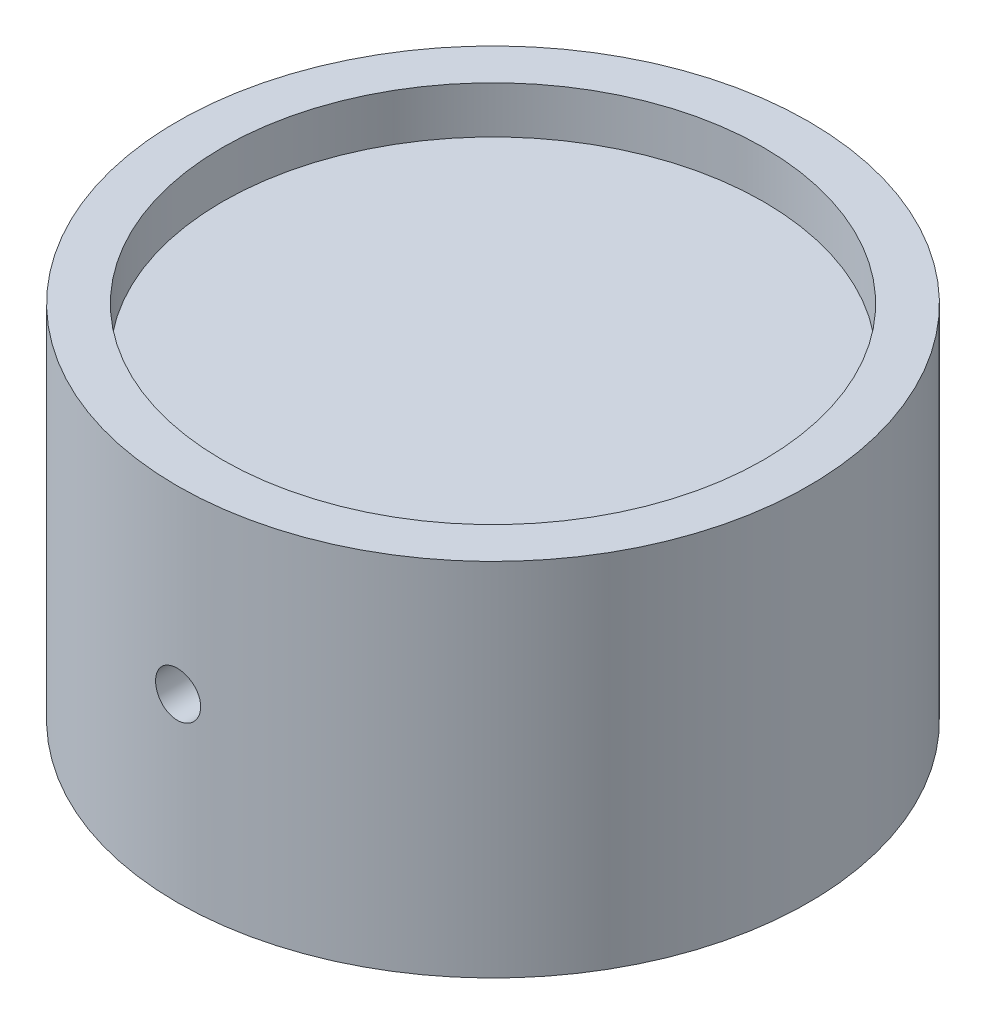
ISO-10303-21;
HEADER;
FILE_DESCRIPTION(('STEP AP214'),'2;1');
FILE_NAME('part.step','',(''),(''),'','','');
FILE_SCHEMA(('AUTOMOTIVE_DESIGN { 1 0 10303 214 1 1 1 1 }'));
ENDSEC;
DATA;
#1=APPLICATION_CONTEXT('core data for automotive mechanical design processes');
#2=APPLICATION_PROTOCOL_DEFINITION('international standard','automotive_design',2000,#1);
#3=PRODUCT_CONTEXT('',#1,'mechanical');
#4=PRODUCT('Part','Part','',(#3));
#5=PRODUCT_RELATED_PRODUCT_CATEGORY('part','',(#4));
#6=PRODUCT_DEFINITION_FORMATION('','',#4);
#7=PRODUCT_DEFINITION_CONTEXT('part definition',#1,'design');
#8=PRODUCT_DEFINITION('design','',#6,#7);
#9=PRODUCT_DEFINITION_SHAPE('','',#8);
#10=(LENGTH_UNIT() NAMED_UNIT(*) SI_UNIT(.MILLI.,.METRE.));
#11=(NAMED_UNIT(*) PLANE_ANGLE_UNIT() SI_UNIT($,.RADIAN.));
#12=(NAMED_UNIT(*) SI_UNIT($,.STERADIAN.) SOLID_ANGLE_UNIT());
#13=UNCERTAINTY_MEASURE_WITH_UNIT(LENGTH_MEASURE(1.E-05),#10,'distance_accuracy_value','');
#14=(GEOMETRIC_REPRESENTATION_CONTEXT(3) GLOBAL_UNCERTAINTY_ASSIGNED_CONTEXT((#13)) GLOBAL_UNIT_ASSIGNED_CONTEXT((#10,
#11,#12)) REPRESENTATION_CONTEXT('',''));
#15=CARTESIAN_POINT('',(0.,0.,0.));
#16=DIRECTION('',(0.,0.,1.));
#17=DIRECTION('',(1.,0.,0.));
#18=AXIS2_PLACEMENT_3D('',#15,#16,#17);
#19=CARTESIAN_POINT('',(0.,25.4,0.));
#20=DIRECTION('',(0.,-1.,0.));
#21=DIRECTION('',(0.,0.,-1.));
#22=AXIS2_PLACEMENT_3D('',#19,#20,#21);
#23=CYLINDRICAL_SURFACE('',#22,22.225);
#24=CARTESIAN_POINT('',(1.58749999999999,12.7,22.1682310694832));
#25=CARTESIAN_POINT('',(1.58749609235026,12.6109515469179,22.168231826125));
#26=CARTESIAN_POINT('',(1.57998224940025,12.5218414219732,22.168773395447));
#27=CARTESIAN_POINT('',(1.55011700578431,12.3460836936577,22.1708813022297));
#28=CARTESIAN_POINT('',(1.52774851511875,12.259439046649,22.1724488199952));
#29=CARTESIAN_POINT('',(1.4688215061279,12.0911834646825,22.1764301750041));
#30=CARTESIAN_POINT('',(1.43227069623717,12.0095698231288,22.1788435524333));
#31=CARTESIAN_POINT('',(1.34602956946576,11.8536567279388,22.1842441178207));
#32=CARTESIAN_POINT('',(1.29634218255635,11.7793556483794,22.1872311777845));
#33=CARTESIAN_POINT('',(1.18513443175129,11.6400134334547,22.1934490084217));
#34=CARTESIAN_POINT('',(1.12359409916664,11.5749882516457,22.1966801846951));
#35=CARTESIAN_POINT('',(0.990469103633874,11.45618043849,22.2030184266813));
#36=CARTESIAN_POINT('',(0.918884014210178,11.402398284736,22.2061254871173));
#37=CARTESIAN_POINT('',(0.767609102895461,11.3075522781098,22.211869075378));
#38=CARTESIAN_POINT('',(0.687910808882627,11.2665019050114,22.2145051032541));
#39=CARTESIAN_POINT('',(0.522731113633086,11.1983709877829,22.2190052930359));
#40=CARTESIAN_POINT('',(0.437249789768195,11.171290256793,22.2208694652659));
#41=CARTESIAN_POINT('',(0.26308664266238,11.1319123805887,22.2236130822647));
#42=CARTESIAN_POINT('',(0.174410584064815,11.1195898587324,22.2244942171804));
#43=CARTESIAN_POINT('',(-0.00375532874157928,11.1099997918277,22.2251781863807));
#44=CARTESIAN_POINT('',(-0.0932451714103631,11.1127320336232,22.2249810359325));
#45=CARTESIAN_POINT('',(-0.270326409054757,11.1331530775943,22.2235320519382));
#46=CARTESIAN_POINT('',(-0.357920969398602,11.1508145867697,22.2222821430117));
#47=CARTESIAN_POINT('',(-0.528899054003579,11.2005504324405,22.2188705225877));
#48=CARTESIAN_POINT('',(-0.612282547319465,11.2326248748329,22.2167088043909));
#49=CARTESIAN_POINT('',(-0.772558865791904,11.3103068257927,22.2117135655237));
#50=CARTESIAN_POINT('',(-0.84944570409023,11.3559266458126,22.2088794341669));
#51=CARTESIAN_POINT('',(-0.994480814460148,11.4593954256644,22.2028581472223));
#52=CARTESIAN_POINT('',(-1.06262895707426,11.5172445666313,22.1996709864058));
#53=CARTESIAN_POINT('',(-1.18841160946314,11.6436838832163,22.1932937313251));
#54=CARTESIAN_POINT('',(-1.24602229898831,11.7122977585049,22.1901036464063));
#55=CARTESIAN_POINT('',(-1.34891088659758,11.8582359908239,22.1840872957399));
#56=CARTESIAN_POINT('',(-1.39418877798898,11.9355603525813,22.1812610301896));
#57=CARTESIAN_POINT('',(-1.4711251115212,12.0967403695783,22.176291610999));
#58=CARTESIAN_POINT('',(-1.50278245876667,12.1805965492421,22.174148512279));
#59=CARTESIAN_POINT('',(-1.55156215570254,12.3524524855519,22.1707889551262));
#60=CARTESIAN_POINT('',(-1.56868472913055,12.4404521783937,22.1695724824297));
#61=CARTESIAN_POINT('',(-1.58787896689999,12.6178891155146,22.1682060548942));
#62=CARTESIAN_POINT('',(-1.58998378448683,12.7073227561323,22.1680537508086));
#63=CARTESIAN_POINT('',(-1.57916947203832,12.8852717314762,22.1688266948214));
#64=CARTESIAN_POINT('',(-1.56625044449786,12.9737870724631,22.1697519355685));
#65=CARTESIAN_POINT('',(-1.5257827442724,13.1472925124985,22.1725735646739));
#66=CARTESIAN_POINT('',(-1.4982494203045,13.2322862093899,22.1744689340766));
#67=CARTESIAN_POINT('',(-1.42935026508389,13.3964469113973,22.1790163866076));
#68=CARTESIAN_POINT('',(-1.38798427014594,13.4756138475503,22.1816684786903));
#69=CARTESIAN_POINT('',(-1.29250960665197,13.6260258324974,22.1874362289003));
#70=CARTESIAN_POINT('',(-1.2383787715021,13.6972567797061,22.1905526899154));
#71=CARTESIAN_POINT('',(-1.11894316675908,13.8296325637712,22.1968952349793));
#72=CARTESIAN_POINT('',(-1.05363825526631,13.890777272523,22.2001213204199));
#73=CARTESIAN_POINT('',(-0.913565347300763,14.0013573569858,22.2063265218481));
#74=CARTESIAN_POINT('',(-0.838780364134121,14.0507712447894,22.2093051782205));
#75=CARTESIAN_POINT('',(-0.681955290350194,14.136339816719,22.2146732914303));
#76=CARTESIAN_POINT('',(-0.599915255526373,14.1724946028004,22.217062752798));
#77=CARTESIAN_POINT('',(-0.430987101631674,14.2304814772378,22.2209810874469));
#78=CARTESIAN_POINT('',(-0.344103628032597,14.2523270419534,22.2225107702702));
#79=CARTESIAN_POINT('',(-0.167890662000527,14.2811194386778,22.2245404462888));
#80=CARTESIAN_POINT('',(-0.0785612023904378,14.288066470512,22.2250404532946));
#81=CARTESIAN_POINT('',(0.0997956802072223,14.2868625264458,22.2249544750983));
#82=CARTESIAN_POINT('',(0.188823332909533,14.2787451218488,22.2243709046617));
#83=CARTESIAN_POINT('',(0.36424788508471,14.2477124946601,22.222188154822));
#84=CARTESIAN_POINT('',(0.450644780291801,14.2247972480749,22.220588973772));
#85=CARTESIAN_POINT('',(0.618359157322722,14.1648274075231,22.2165546178347));
#86=CARTESIAN_POINT('',(0.699676760831319,14.1277731524366,22.2141194629839));
#87=CARTESIAN_POINT('',(0.854941617955433,14.0405813581598,22.2086861856915));
#88=CARTESIAN_POINT('',(0.928889033140696,13.9904441058631,22.2056880755952));
#89=CARTESIAN_POINT('',(1.06748556601891,13.8783842592438,22.1994578933056));
#90=CARTESIAN_POINT('',(1.13211478442566,13.8164370804927,22.1962253419365));
#91=CARTESIAN_POINT('',(1.25008114805185,13.6825549488328,22.1898945892428));
#92=CARTESIAN_POINT('',(1.30341553769478,13.6106175657055,22.1867964208497));
#93=CARTESIAN_POINT('',(1.39733042464984,13.458692553558,22.181080148508));
#94=CARTESIAN_POINT('',(1.43789184941007,13.3786931192099,22.1784627648711));
#95=CARTESIAN_POINT('',(1.50495635417649,13.213057476119,22.174013428587));
#96=CARTESIAN_POINT('',(1.53147578079666,13.1274279526764,22.1721805631426));
#97=CARTESIAN_POINT('',(1.56286515421334,12.9844014469465,22.169984621917));
#98=CARTESIAN_POINT('',(1.57209114476269,12.9279272505286,22.1693300112595));
#99=CARTESIAN_POINT('',(1.58440981622643,12.8143105078716,22.1684529925713));
#100=CARTESIAN_POINT('',(1.58750250866092,12.7571679628879,22.1682305837289));
#101=CARTESIAN_POINT('',(1.58749999999999,12.7,22.1682310694832));
#102=B_SPLINE_CURVE_WITH_KNOTS('',3,(#24,#25,#26,#27,#28,#29,#30,#31,#32,#33,#34,#35,#36,#37,
#38,#39,#40,#41,#42,#43,#44,#45,#46,#47,#48,#49,#50,#51,#52,#53,#54,#55,#56,#57,#58,#59,#60,#61,
#62,#63,#64,#65,#66,#67,#68,#69,#70,#71,#72,#73,#74,#75,#76,#77,#78,#79,#80,#81,#82,#83,#84,#85,
#86,#87,#88,#89,#90,#91,#92,#93,#94,#95,#96,#97,#98,#99,#100,#101),.UNSPECIFIED.,.T.,.F.,(4,2,2,
2,2,2,2,2,2,2,2,2,2,2,2,2,2,2,2,2,2,2,2,2,2,2,2,2,2,2,2,2,2,2,2,2,2,2,4),(0.,0.26693664820637,
0.53418093540041,0.8012801718509,1.0683198848925,1.33581347901297,1.60331843368927,
1.8711056499855,2.13888928423433,2.40621180218837,2.67353053520931,2.9403616227095,
3.20719467074668,3.47427099079376,3.74135126692694,4.009028019754,4.27670491784191,
4.54440332927402,4.81209761987876,5.0792007643521,5.34630208661911,5.61312343822547,
5.87994794730301,6.14723926368506,6.41453397465226,6.68231458818024,6.95009314257618,
7.21761914034851,7.48514154992331,7.75206849791231,8.01899587870051,8.28591686224559,
8.55283199304393,8.82030894428228,9.08785107634614,9.35579082771651,9.62341797464419,
9.79478819538489,9.96615809424217),.UNSPECIFIED.);
#103=CARTESIAN_POINT('',(1.58749999999999,12.7,22.1682310694832));
#104=VERTEX_POINT('',#103);
#105=EDGE_CURVE('E11',#104,#104,#102,.T.);
#106=ORIENTED_EDGE('',*,*,#105,.T.);
#107=EDGE_LOOP('',(#106));
#108=FACE_BOUND('',#107,.T.);
#109=CARTESIAN_POINT('',(0.,25.4,0.));
#110=DIRECTION('',(0.,1.,0.));
#111=DIRECTION('',(0.,0.,1.));
#112=AXIS2_PLACEMENT_3D('',#109,#110,#111);
#113=CIRCLE('',#112,22.225);
#114=CARTESIAN_POINT('',(0.,25.4,22.225));
#115=VERTEX_POINT('',#114);
#116=EDGE_CURVE('E48',#115,#115,#113,.T.);
#117=ORIENTED_EDGE('',*,*,#116,.F.);
#118=EDGE_LOOP('',(#117));
#119=FACE_BOUND('',#118,.T.);
#120=CARTESIAN_POINT('',(0.,0.,0.));
#121=DIRECTION('',(0.,1.,0.));
#122=DIRECTION('',(0.,0.,1.));
#123=AXIS2_PLACEMENT_3D('',#120,#121,#122);
#124=CIRCLE('',#123,22.225);
#125=CARTESIAN_POINT('',(0.,0.,22.225));
#126=VERTEX_POINT('',#125);
#127=EDGE_CURVE('E74',#126,#126,#124,.T.);
#128=ORIENTED_EDGE('',*,*,#127,.T.);
#129=EDGE_LOOP('',(#128));
#130=FACE_BOUND('',#129,.T.);
#131=ADVANCED_FACE('F37',(#108,#119,#130),#23,.T.);
#132=CARTESIAN_POINT('',(0.,25.4,0.));
#133=DIRECTION('',(0.,1.,0.));
#134=DIRECTION('',(0.,0.,1.));
#135=AXIS2_PLACEMENT_3D('',#132,#133,#134);
#136=PLANE('',#135);
#137=CARTESIAN_POINT('',(0.,25.4,0.));
#138=DIRECTION('',(0.,1.,0.));
#139=DIRECTION('',(0.,0.,1.));
#140=AXIS2_PLACEMENT_3D('',#137,#138,#139);
#141=CIRCLE('',#140,19.05);
#142=CARTESIAN_POINT('',(0.,25.4,19.05));
#143=VERTEX_POINT('',#142);
#144=EDGE_CURVE('E68',#143,#143,#141,.T.);
#145=ORIENTED_EDGE('',*,*,#144,.F.);
#146=EDGE_LOOP('',(#145));
#147=FACE_BOUND('',#146,.T.);
#148=ORIENTED_EDGE('',*,*,#116,.T.);
#149=EDGE_LOOP('',(#148));
#150=FACE_BOUND('',#149,.T.);
#151=ADVANCED_FACE('F83',(#147,#150),#136,.T.);
#152=CARTESIAN_POINT('',(0.,0.,0.));
#153=DIRECTION('',(0.,1.,0.));
#154=DIRECTION('',(0.,0.,1.));
#155=AXIS2_PLACEMENT_3D('',#152,#153,#154);
#156=PLANE('',#155);
#157=CARTESIAN_POINT('',(0.,0.,0.));
#158=DIRECTION('',(0.,-1.,0.));
#159=DIRECTION('',(0.,0.,-1.));
#160=AXIS2_PLACEMENT_3D('',#157,#158,#159);
#161=CIRCLE('',#160,19.05);
#162=CARTESIAN_POINT('',(0.,0.,-19.05));
#163=VERTEX_POINT('',#162);
#164=EDGE_CURVE('E60',#163,#163,#161,.T.);
#165=ORIENTED_EDGE('',*,*,#164,.F.);
#166=EDGE_LOOP('',(#165));
#167=FACE_BOUND('',#166,.T.);
#168=ORIENTED_EDGE('',*,*,#127,.F.);
#169=EDGE_LOOP('',(#168));
#170=FACE_BOUND('',#169,.T.);
#171=ADVANCED_FACE('F80',(#167,#170),#156,.F.);
#172=CARTESIAN_POINT('',(0.,22.098,0.));
#173=DIRECTION('',(0.,-1.,0.));
#174=DIRECTION('',(0.,0.,-1.));
#175=AXIS2_PLACEMENT_3D('',#172,#173,#174);
#176=PLANE('',#175);
#177=CARTESIAN_POINT('',(0.,22.098,0.));
#178=DIRECTION('',(0.,1.,0.));
#179=DIRECTION('',(0.,0.,1.));
#180=AXIS2_PLACEMENT_3D('',#177,#178,#179);
#181=CIRCLE('',#180,19.05);
#182=CARTESIAN_POINT('',(0.,22.098,19.05));
#183=VERTEX_POINT('',#182);
#184=EDGE_CURVE('E71',#183,#183,#181,.T.);
#185=ORIENTED_EDGE('',*,*,#184,.T.);
#186=EDGE_LOOP('',(#185));
#187=FACE_BOUND('',#186,.T.);
#188=ADVANCED_FACE('F82',(#187),#176,.F.);
#189=CARTESIAN_POINT('',(0.,25.4,0.));
#190=DIRECTION('',(0.,1.,0.));
#191=DIRECTION('',(0.,0.,1.));
#192=AXIS2_PLACEMENT_3D('',#189,#190,#191);
#193=CYLINDRICAL_SURFACE('',#192,19.05);
#194=ORIENTED_EDGE('',*,*,#184,.F.);
#195=EDGE_LOOP('',(#194));
#196=FACE_BOUND('',#195,.T.);
#197=ORIENTED_EDGE('',*,*,#144,.T.);
#198=EDGE_LOOP('',(#197));
#199=FACE_BOUND('',#198,.T.);
#200=ADVANCED_FACE('F89',(#196,#199),#193,.F.);
#201=CARTESIAN_POINT('',(0.,3.302,0.));
#202=DIRECTION('',(0.,1.,0.));
#203=DIRECTION('',(0.,0.,1.));
#204=AXIS2_PLACEMENT_3D('',#201,#202,#203);
#205=PLANE('',#204);
#206=CARTESIAN_POINT('',(0.,3.302,0.));
#207=DIRECTION('',(0.,-1.,0.));
#208=DIRECTION('',(0.,0.,-1.));
#209=AXIS2_PLACEMENT_3D('',#206,#207,#208);
#210=CIRCLE('',#209,19.05);
#211=CARTESIAN_POINT('',(0.,3.302,-19.05));
#212=VERTEX_POINT('',#211);
#213=EDGE_CURVE('E63',#212,#212,#210,.T.);
#214=ORIENTED_EDGE('',*,*,#213,.T.);
#215=EDGE_LOOP('',(#214));
#216=FACE_BOUND('',#215,.T.);
#217=ADVANCED_FACE('F109',(#216),#205,.F.);
#218=CARTESIAN_POINT('',(0.,0.,0.));
#219=DIRECTION('',(0.,-1.,0.));
#220=DIRECTION('',(0.,0.,-1.));
#221=AXIS2_PLACEMENT_3D('',#218,#219,#220);
#222=CYLINDRICAL_SURFACE('',#221,19.05);
#223=ORIENTED_EDGE('',*,*,#213,.F.);
#224=EDGE_LOOP('',(#223));
#225=FACE_BOUND('',#224,.T.);
#226=ORIENTED_EDGE('',*,*,#164,.T.);
#227=EDGE_LOOP('',(#226));
#228=FACE_BOUND('',#227,.T.);
#229=ADVANCED_FACE('F105',(#225,#228),#222,.F.);
#230=CARTESIAN_POINT('',(0.,12.7,22.225));
#231=DIRECTION('',(0.,0.,1.));
#232=DIRECTION('',(1.,0.,0.));
#233=AXIS2_PLACEMENT_3D('',#230,#231,#232);
#234=CYLINDRICAL_SURFACE('',#233,1.58749999999999);
#235=CARTESIAN_POINT('',(0.,12.7,6.223));
#236=DIRECTION('',(0.,0.,1.));
#237=DIRECTION('',(1.,0.,0.));
#238=AXIS2_PLACEMENT_3D('',#235,#236,#237);
#239=CIRCLE('',#238,1.5875);
#240=CARTESIAN_POINT('',(1.5875,12.7,6.223));
#241=VERTEX_POINT('',#240);
#242=EDGE_CURVE('E58',#241,#241,#239,.T.);
#243=ORIENTED_EDGE('',*,*,#242,.F.);
#244=EDGE_LOOP('',(#243));
#245=FACE_BOUND('',#244,.T.);
#246=ORIENTED_EDGE('',*,*,#105,.F.);
#247=EDGE_LOOP('',(#246));
#248=FACE_BOUND('',#247,.T.);
#249=ADVANCED_FACE('F54',(#245,#248),#234,.F.);
#250=CARTESIAN_POINT('',(0.,12.7,6.223));
#251=DIRECTION('',(0.,0.,1.));
#252=DIRECTION('',(1.,0.,0.));
#253=AXIS2_PLACEMENT_3D('',#250,#251,#252);
#254=CONICAL_SURFACE('',#253,1.5875,1.02974425867665);
#255=CARTESIAN_POINT('',(0.,12.7,5.26913376729375));
#256=VERTEX_POINT('',#255);
#257=VERTEX_LOOP('',#256);
#258=FACE_BOUND('',#257,.T.);
#259=ORIENTED_EDGE('',*,*,#242,.T.);
#260=EDGE_LOOP('',(#259));
#261=FACE_BOUND('',#260,.T.);
#262=ADVANCED_FACE('F51',(#258,#261),#254,.F.);
#263=CLOSED_SHELL('',(#131,#151,#171,#188,#200,#217,#229,#249,#262));
#264=MANIFOLD_SOLID_BREP('B2',#263);
#265=ADVANCED_BREP_SHAPE_REPRESENTATION('',(#18,#264),#14);
#266=SHAPE_DEFINITION_REPRESENTATION(#9,#265);
ENDSEC;
END-ISO-10303-21;
